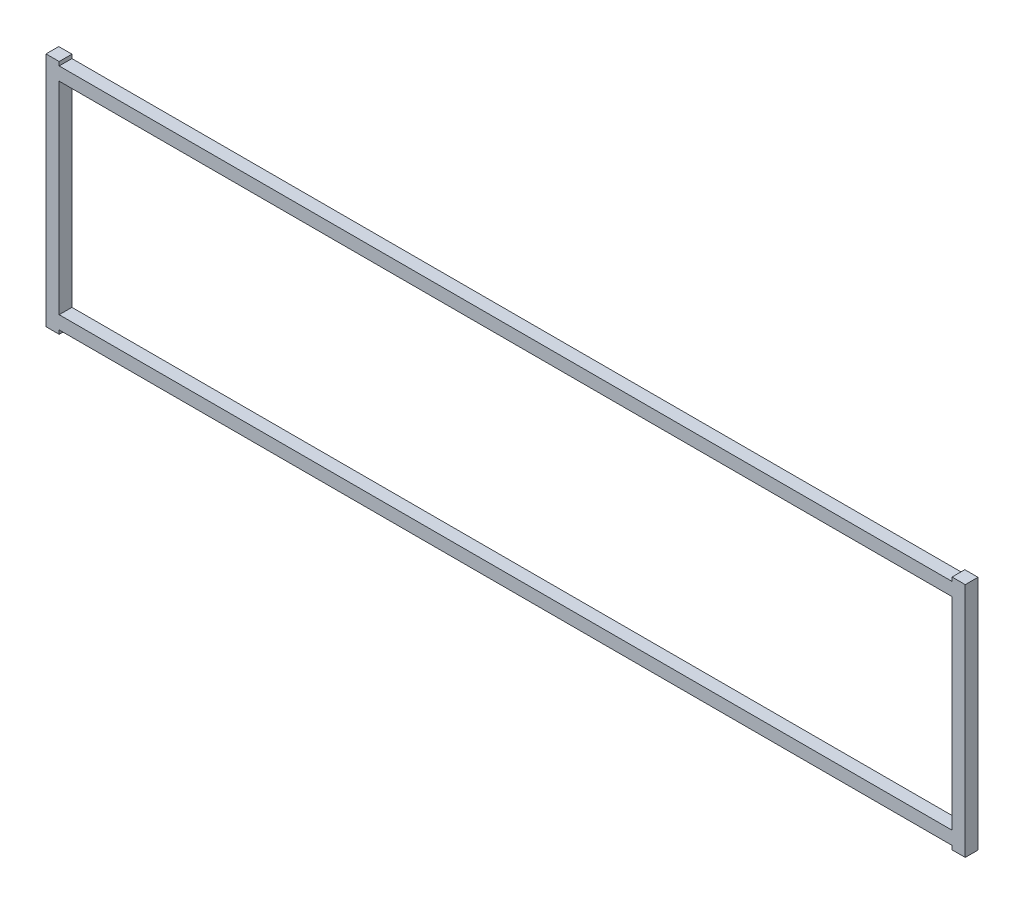
ISO-10303-21;
HEADER;
FILE_DESCRIPTION(('STEP AP214'),'2;1');
FILE_NAME('part.step','',(''),(''),'','','');
FILE_SCHEMA(('AUTOMOTIVE_DESIGN { 1 0 10303 214 1 1 1 1 }'));
ENDSEC;
DATA;
#1=APPLICATION_CONTEXT('core data for automotive mechanical design processes');
#2=APPLICATION_PROTOCOL_DEFINITION('international standard','automotive_design',2000,#1);
#3=PRODUCT_CONTEXT('',#1,'mechanical');
#4=PRODUCT('Part','Part','',(#3));
#5=PRODUCT_RELATED_PRODUCT_CATEGORY('part','',(#4));
#6=PRODUCT_DEFINITION_FORMATION('','',#4);
#7=PRODUCT_DEFINITION_CONTEXT('part definition',#1,'design');
#8=PRODUCT_DEFINITION('design','',#6,#7);
#9=PRODUCT_DEFINITION_SHAPE('','',#8);
#10=(LENGTH_UNIT() NAMED_UNIT(*) SI_UNIT(.MILLI.,.METRE.));
#11=(NAMED_UNIT(*) PLANE_ANGLE_UNIT() SI_UNIT($,.RADIAN.));
#12=(NAMED_UNIT(*) SI_UNIT($,.STERADIAN.) SOLID_ANGLE_UNIT());
#13=UNCERTAINTY_MEASURE_WITH_UNIT(LENGTH_MEASURE(1.E-05),#10,'distance_accuracy_value','');
#14=(GEOMETRIC_REPRESENTATION_CONTEXT(3) GLOBAL_UNCERTAINTY_ASSIGNED_CONTEXT((#13)) GLOBAL_UNIT_ASSIGNED_CONTEXT((#10,
#11,#12)) REPRESENTATION_CONTEXT('',''));
#15=CARTESIAN_POINT('',(0.,0.,0.));
#16=DIRECTION('',(0.,0.,1.));
#17=DIRECTION('',(1.,0.,0.));
#18=AXIS2_PLACEMENT_3D('',#15,#16,#17);
#19=CARTESIAN_POINT('',(0.,0.,6.35));
#20=DIRECTION('',(0.,0.,1.));
#21=DIRECTION('',(1.,0.,0.));
#22=AXIS2_PLACEMENT_3D('',#19,#20,#21);
#23=PLANE('',#22);
#24=DIRECTION('',(0.,-1.,0.));
#25=VECTOR('',#24,1.);
#26=CARTESIAN_POINT('',(222.1484,-56.87695,6.35));
#27=LINE('',#26,#25);
#28=CARTESIAN_POINT('',(222.1484,-56.87695,6.35));
#29=VERTEX_POINT('',#28);
#30=CARTESIAN_POINT('',(222.1484,-58.785125,6.35));
#31=VERTEX_POINT('',#30);
#32=EDGE_CURVE('E182',#29,#31,#27,.T.);
#33=ORIENTED_EDGE('',*,*,#32,.T.);
#34=DIRECTION('',(1.,0.,0.));
#35=VECTOR('',#34,1.);
#36=CARTESIAN_POINT('',(222.1484,-58.785125,6.35));
#37=LINE('',#36,#35);
#38=CARTESIAN_POINT('',(228.7016,-58.785125,6.35));
#39=VERTEX_POINT('',#38);
#40=EDGE_CURVE('E185',#31,#39,#37,.T.);
#41=ORIENTED_EDGE('',*,*,#40,.T.);
#42=DIRECTION('',(0.,1.,0.));
#43=VECTOR('',#42,1.);
#44=CARTESIAN_POINT('',(228.7016,-58.785125,6.35));
#45=LINE('',#44,#43);
#46=CARTESIAN_POINT('',(228.7016,58.785125,6.35));
#47=VERTEX_POINT('',#46);
#48=EDGE_CURVE('E188',#39,#47,#45,.T.);
#49=ORIENTED_EDGE('',*,*,#48,.T.);
#50=DIRECTION('',(-1.,0.,0.));
#51=VECTOR('',#50,1.);
#52=CARTESIAN_POINT('',(228.7016,58.785125,6.35));
#53=LINE('',#52,#51);
#54=CARTESIAN_POINT('',(222.1484,58.785125,6.35));
#55=VERTEX_POINT('',#54);
#56=EDGE_CURVE('E190',#47,#55,#53,.T.);
#57=ORIENTED_EDGE('',*,*,#56,.T.);
#58=DIRECTION('',(0.,-1.,0.));
#59=VECTOR('',#58,1.);
#60=CARTESIAN_POINT('',(222.1484,58.785125,6.35));
#61=LINE('',#60,#59);
#62=CARTESIAN_POINT('',(222.1484,56.87695,6.35));
#63=VERTEX_POINT('',#62);
#64=EDGE_CURVE('E192',#55,#63,#61,.T.);
#65=ORIENTED_EDGE('',*,*,#64,.T.);
#66=DIRECTION('',(-1.,0.,0.));
#67=VECTOR('',#66,1.);
#68=CARTESIAN_POINT('',(222.1484,56.87695,6.35));
#69=LINE('',#68,#67);
#70=CARTESIAN_POINT('',(-222.1484,56.87695,6.35));
#71=VERTEX_POINT('',#70);
#72=EDGE_CURVE('E194',#63,#71,#69,.T.);
#73=ORIENTED_EDGE('',*,*,#72,.T.);
#74=DIRECTION('',(0.,1.,0.));
#75=VECTOR('',#74,1.);
#76=CARTESIAN_POINT('',(-222.1484,56.87695,6.35));
#77=LINE('',#76,#75);
#78=CARTESIAN_POINT('',(-222.1484,58.785125,6.35));
#79=VERTEX_POINT('',#78);
#80=EDGE_CURVE('E196',#71,#79,#77,.T.);
#81=ORIENTED_EDGE('',*,*,#80,.T.);
#82=DIRECTION('',(-1.,0.,0.));
#83=VECTOR('',#82,1.);
#84=CARTESIAN_POINT('',(-222.1484,58.785125,6.35));
#85=LINE('',#84,#83);
#86=CARTESIAN_POINT('',(-228.7016,58.785125,6.35));
#87=VERTEX_POINT('',#86);
#88=EDGE_CURVE('E198',#79,#87,#85,.T.);
#89=ORIENTED_EDGE('',*,*,#88,.T.);
#90=DIRECTION('',(0.,-1.,0.));
#91=VECTOR('',#90,1.);
#92=CARTESIAN_POINT('',(-228.7016,58.785125,6.35));
#93=LINE('',#92,#91);
#94=CARTESIAN_POINT('',(-228.7016,-58.785125,6.35));
#95=VERTEX_POINT('',#94);
#96=EDGE_CURVE('E200',#87,#95,#93,.T.);
#97=ORIENTED_EDGE('',*,*,#96,.T.);
#98=DIRECTION('',(1.,0.,0.));
#99=VECTOR('',#98,1.);
#100=CARTESIAN_POINT('',(-228.7016,-58.785125,6.35));
#101=LINE('',#100,#99);
#102=CARTESIAN_POINT('',(-222.1484,-58.785125,6.35));
#103=VERTEX_POINT('',#102);
#104=EDGE_CURVE('E202',#95,#103,#101,.T.);
#105=ORIENTED_EDGE('',*,*,#104,.T.);
#106=DIRECTION('',(0.,1.,0.));
#107=VECTOR('',#106,1.);
#108=CARTESIAN_POINT('',(-222.1484,-58.785125,6.35));
#109=LINE('',#108,#107);
#110=CARTESIAN_POINT('',(-222.1484,-56.87695,6.35));
#111=VERTEX_POINT('',#110);
#112=EDGE_CURVE('E204',#103,#111,#109,.T.);
#113=ORIENTED_EDGE('',*,*,#112,.T.);
#114=DIRECTION('',(1.,0.,0.));
#115=VECTOR('',#114,1.);
#116=CARTESIAN_POINT('',(-222.1484,-56.87695,6.35));
#117=LINE('',#116,#115);
#118=EDGE_CURVE('E206',#111,#29,#117,.T.);
#119=ORIENTED_EDGE('',*,*,#118,.T.);
#120=EDGE_LOOP('',(#33,#41,#49,#57,#65,#73,#81,#89,#97,#105,#113,#119));
#121=FACE_BOUND('',#120,.T.);
#122=DIRECTION('',(0.,1.,0.));
#123=VECTOR('',#122,1.);
#124=CARTESIAN_POINT('',(222.1484,-50.32375,6.35));
#125=LINE('',#124,#123);
#126=CARTESIAN_POINT('',(222.1484,-50.32375,6.35));
#127=VERTEX_POINT('',#126);
#128=CARTESIAN_POINT('',(222.1484,50.32375,6.35));
#129=VERTEX_POINT('',#128);
#130=EDGE_CURVE('E154',#127,#129,#125,.T.);
#131=ORIENTED_EDGE('',*,*,#130,.F.);
#132=DIRECTION('',(1.,0.,0.));
#133=VECTOR('',#132,1.);
#134=CARTESIAN_POINT('',(-222.1484,-50.32375,6.35));
#135=LINE('',#134,#133);
#136=CARTESIAN_POINT('',(-222.1484,-50.32375,6.35));
#137=VERTEX_POINT('',#136);
#138=EDGE_CURVE('E146',#137,#127,#135,.T.);
#139=ORIENTED_EDGE('',*,*,#138,.F.);
#140=DIRECTION('',(0.,-1.,0.));
#141=VECTOR('',#140,1.);
#142=CARTESIAN_POINT('',(-222.1484,50.32375,6.35));
#143=LINE('',#142,#141);
#144=CARTESIAN_POINT('',(-222.1484,50.32375,6.35));
#145=VERTEX_POINT('',#144);
#146=EDGE_CURVE('E168',#145,#137,#143,.T.);
#147=ORIENTED_EDGE('',*,*,#146,.F.);
#148=DIRECTION('',(-1.,0.,0.));
#149=VECTOR('',#148,1.);
#150=CARTESIAN_POINT('',(222.1484,50.32375,6.35));
#151=LINE('',#150,#149);
#152=EDGE_CURVE('E166',#129,#145,#151,.T.);
#153=ORIENTED_EDGE('',*,*,#152,.F.);
#154=EDGE_LOOP('',(#131,#139,#147,#153));
#155=FACE_BOUND('',#154,.T.);
#156=ADVANCED_FACE('F33',(#121,#155),#23,.T.);
#157=CARTESIAN_POINT('',(0.,0.,0.));
#158=DIRECTION('',(0.,0.,1.));
#159=DIRECTION('',(1.,0.,0.));
#160=AXIS2_PLACEMENT_3D('',#157,#158,#159);
#161=PLANE('',#160);
#162=DIRECTION('',(0.,-1.,0.));
#163=VECTOR('',#162,1.);
#164=CARTESIAN_POINT('',(222.1484,-56.87695,0.));
#165=LINE('',#164,#163);
#166=CARTESIAN_POINT('',(222.1484,-56.87695,0.));
#167=VERTEX_POINT('',#166);
#168=CARTESIAN_POINT('',(222.1484,-58.785125,0.));
#169=VERTEX_POINT('',#168);
#170=EDGE_CURVE('E162',#167,#169,#165,.T.);
#171=ORIENTED_EDGE('',*,*,#170,.F.);
#172=DIRECTION('',(1.,0.,0.));
#173=VECTOR('',#172,1.);
#174=CARTESIAN_POINT('',(-222.1484,-56.87695,0.));
#175=LINE('',#174,#173);
#176=CARTESIAN_POINT('',(-222.1484,-56.87695,0.));
#177=VERTEX_POINT('',#176);
#178=EDGE_CURVE('E186',#177,#167,#175,.T.);
#179=ORIENTED_EDGE('',*,*,#178,.F.);
#180=DIRECTION('',(0.,1.,0.));
#181=VECTOR('',#180,1.);
#182=CARTESIAN_POINT('',(-222.1484,-58.785125,0.));
#183=LINE('',#182,#181);
#184=CARTESIAN_POINT('',(-222.1484,-58.785125,0.));
#185=VERTEX_POINT('',#184);
#186=EDGE_CURVE('E229',#185,#177,#183,.T.);
#187=ORIENTED_EDGE('',*,*,#186,.F.);
#188=DIRECTION('',(1.,0.,0.));
#189=VECTOR('',#188,1.);
#190=CARTESIAN_POINT('',(-228.7016,-58.785125,0.));
#191=LINE('',#190,#189);
#192=CARTESIAN_POINT('',(-228.7016,-58.785125,0.));
#193=VERTEX_POINT('',#192);
#194=EDGE_CURVE('E227',#193,#185,#191,.T.);
#195=ORIENTED_EDGE('',*,*,#194,.F.);
#196=DIRECTION('',(0.,-1.,0.));
#197=VECTOR('',#196,1.);
#198=CARTESIAN_POINT('',(-228.7016,58.785125,0.));
#199=LINE('',#198,#197);
#200=CARTESIAN_POINT('',(-228.7016,58.785125,0.));
#201=VERTEX_POINT('',#200);
#202=EDGE_CURVE('E225',#201,#193,#199,.T.);
#203=ORIENTED_EDGE('',*,*,#202,.F.);
#204=DIRECTION('',(-1.,0.,0.));
#205=VECTOR('',#204,1.);
#206=CARTESIAN_POINT('',(-222.1484,58.785125,0.));
#207=LINE('',#206,#205);
#208=CARTESIAN_POINT('',(-222.1484,58.785125,0.));
#209=VERTEX_POINT('',#208);
#210=EDGE_CURVE('E223',#209,#201,#207,.T.);
#211=ORIENTED_EDGE('',*,*,#210,.F.);
#212=DIRECTION('',(0.,1.,0.));
#213=VECTOR('',#212,1.);
#214=CARTESIAN_POINT('',(-222.1484,56.87695,0.));
#215=LINE('',#214,#213);
#216=CARTESIAN_POINT('',(-222.1484,56.87695,0.));
#217=VERTEX_POINT('',#216);
#218=EDGE_CURVE('E221',#217,#209,#215,.T.);
#219=ORIENTED_EDGE('',*,*,#218,.F.);
#220=DIRECTION('',(-1.,0.,0.));
#221=VECTOR('',#220,1.);
#222=CARTESIAN_POINT('',(222.1484,56.87695,0.));
#223=LINE('',#222,#221);
#224=CARTESIAN_POINT('',(222.1484,56.87695,0.));
#225=VERTEX_POINT('',#224);
#226=EDGE_CURVE('E219',#225,#217,#223,.T.);
#227=ORIENTED_EDGE('',*,*,#226,.F.);
#228=DIRECTION('',(0.,-1.,0.));
#229=VECTOR('',#228,1.);
#230=CARTESIAN_POINT('',(222.1484,58.785125,0.));
#231=LINE('',#230,#229);
#232=CARTESIAN_POINT('',(222.1484,58.785125,0.));
#233=VERTEX_POINT('',#232);
#234=EDGE_CURVE('E217',#233,#225,#231,.T.);
#235=ORIENTED_EDGE('',*,*,#234,.F.);
#236=DIRECTION('',(-1.,0.,0.));
#237=VECTOR('',#236,1.);
#238=CARTESIAN_POINT('',(228.7016,58.785125,0.));
#239=LINE('',#238,#237);
#240=CARTESIAN_POINT('',(228.7016,58.785125,0.));
#241=VERTEX_POINT('',#240);
#242=EDGE_CURVE('E215',#241,#233,#239,.T.);
#243=ORIENTED_EDGE('',*,*,#242,.F.);
#244=DIRECTION('',(0.,1.,0.));
#245=VECTOR('',#244,1.);
#246=CARTESIAN_POINT('',(228.7016,-58.785125,0.));
#247=LINE('',#246,#245);
#248=CARTESIAN_POINT('',(228.7016,-58.785125,0.));
#249=VERTEX_POINT('',#248);
#250=EDGE_CURVE('E213',#249,#241,#247,.T.);
#251=ORIENTED_EDGE('',*,*,#250,.F.);
#252=DIRECTION('',(1.,0.,0.));
#253=VECTOR('',#252,1.);
#254=CARTESIAN_POINT('',(222.1484,-58.785125,0.));
#255=LINE('',#254,#253);
#256=EDGE_CURVE('E211',#169,#249,#255,.T.);
#257=ORIENTED_EDGE('',*,*,#256,.F.);
#258=EDGE_LOOP('',(#171,#179,#187,#195,#203,#211,#219,#227,#235,#243,#251,#257));
#259=FACE_BOUND('',#258,.T.);
#260=DIRECTION('',(1.,0.,0.));
#261=VECTOR('',#260,1.);
#262=CARTESIAN_POINT('',(-222.1484,-50.32375,0.));
#263=LINE('',#262,#261);
#264=CARTESIAN_POINT('',(-222.1484,-50.32375,0.));
#265=VERTEX_POINT('',#264);
#266=CARTESIAN_POINT('',(222.1484,-50.32375,0.));
#267=VERTEX_POINT('',#266);
#268=EDGE_CURVE('E56',#265,#267,#263,.T.);
#269=ORIENTED_EDGE('',*,*,#268,.T.);
#270=DIRECTION('',(0.,1.,0.));
#271=VECTOR('',#270,1.);
#272=CARTESIAN_POINT('',(222.1484,-50.32375,0.));
#273=LINE('',#272,#271);
#274=CARTESIAN_POINT('',(222.1484,50.32375,0.));
#275=VERTEX_POINT('',#274);
#276=EDGE_CURVE('E161',#267,#275,#273,.T.);
#277=ORIENTED_EDGE('',*,*,#276,.T.);
#278=DIRECTION('',(-1.,0.,0.));
#279=VECTOR('',#278,1.);
#280=CARTESIAN_POINT('',(222.1484,50.32375,0.));
#281=LINE('',#280,#279);
#282=CARTESIAN_POINT('',(-222.1484,50.32375,0.));
#283=VERTEX_POINT('',#282);
#284=EDGE_CURVE('E174',#275,#283,#281,.T.);
#285=ORIENTED_EDGE('',*,*,#284,.T.);
#286=DIRECTION('',(0.,-1.,0.));
#287=VECTOR('',#286,1.);
#288=CARTESIAN_POINT('',(-222.1484,50.32375,0.));
#289=LINE('',#288,#287);
#290=EDGE_CURVE('E155',#283,#265,#289,.T.);
#291=ORIENTED_EDGE('',*,*,#290,.T.);
#292=EDGE_LOOP('',(#269,#277,#285,#291));
#293=FACE_BOUND('',#292,.T.);
#294=ADVANCED_FACE('F271',(#259,#293),#161,.F.);
#295=CARTESIAN_POINT('',(222.1484,-56.87695,6.35));
#296=DIRECTION('',(1.,0.,0.));
#297=DIRECTION('',(0.,0.,-1.));
#298=AXIS2_PLACEMENT_3D('',#295,#296,#297);
#299=PLANE('',#298);
#300=ORIENTED_EDGE('',*,*,#170,.T.);
#301=DIRECTION('',(0.,0.,-1.));
#302=VECTOR('',#301,1.);
#303=CARTESIAN_POINT('',(222.1484,-58.785125,6.35));
#304=LINE('',#303,#302);
#305=EDGE_CURVE('E11',#31,#169,#304,.T.);
#306=ORIENTED_EDGE('',*,*,#305,.F.);
#307=ORIENTED_EDGE('',*,*,#32,.F.);
#308=DIRECTION('',(0.,0.,-1.));
#309=VECTOR('',#308,1.);
#310=CARTESIAN_POINT('',(222.1484,-56.87695,6.35));
#311=LINE('',#310,#309);
#312=EDGE_CURVE('E208',#29,#167,#311,.T.);
#313=ORIENTED_EDGE('',*,*,#312,.T.);
#314=EDGE_LOOP('',(#300,#306,#307,#313));
#315=FACE_BOUND('',#314,.T.);
#316=ADVANCED_FACE('F35',(#315),#299,.F.);
#317=CARTESIAN_POINT('',(222.1484,-58.785125,6.35));
#318=DIRECTION('',(0.,1.,0.));
#319=DIRECTION('',(0.,0.,1.));
#320=AXIS2_PLACEMENT_3D('',#317,#318,#319);
#321=PLANE('',#320);
#322=ORIENTED_EDGE('',*,*,#256,.T.);
#323=DIRECTION('',(0.,0.,-1.));
#324=VECTOR('',#323,1.);
#325=CARTESIAN_POINT('',(228.7016,-58.785125,6.35));
#326=LINE('',#325,#324);
#327=EDGE_CURVE('E41',#39,#249,#326,.T.);
#328=ORIENTED_EDGE('',*,*,#327,.F.);
#329=ORIENTED_EDGE('',*,*,#40,.F.);
#330=ORIENTED_EDGE('',*,*,#305,.T.);
#331=EDGE_LOOP('',(#322,#328,#329,#330));
#332=FACE_BOUND('',#331,.T.);
#333=ADVANCED_FACE('F288',(#332),#321,.F.);
#334=CARTESIAN_POINT('',(228.7016,-58.785125,6.35));
#335=DIRECTION('',(-1.,0.,0.));
#336=DIRECTION('',(0.,0.,1.));
#337=AXIS2_PLACEMENT_3D('',#334,#335,#336);
#338=PLANE('',#337);
#339=ORIENTED_EDGE('',*,*,#250,.T.);
#340=DIRECTION('',(0.,0.,-1.));
#341=VECTOR('',#340,1.);
#342=CARTESIAN_POINT('',(228.7016,58.785125,6.35));
#343=LINE('',#342,#341);
#344=EDGE_CURVE('E258',#47,#241,#343,.T.);
#345=ORIENTED_EDGE('',*,*,#344,.F.);
#346=ORIENTED_EDGE('',*,*,#48,.F.);
#347=ORIENTED_EDGE('',*,*,#327,.T.);
#348=EDGE_LOOP('',(#339,#345,#346,#347));
#349=FACE_BOUND('',#348,.T.);
#350=ADVANCED_FACE('F265',(#349),#338,.F.);
#351=CARTESIAN_POINT('',(228.7016,58.785125,6.35));
#352=DIRECTION('',(0.,-1.,0.));
#353=DIRECTION('',(0.,0.,-1.));
#354=AXIS2_PLACEMENT_3D('',#351,#352,#353);
#355=PLANE('',#354);
#356=ORIENTED_EDGE('',*,*,#242,.T.);
#357=DIRECTION('',(0.,0.,-1.));
#358=VECTOR('',#357,1.);
#359=CARTESIAN_POINT('',(222.1484,58.785125,6.35));
#360=LINE('',#359,#358);
#361=EDGE_CURVE('E255',#55,#233,#360,.T.);
#362=ORIENTED_EDGE('',*,*,#361,.F.);
#363=ORIENTED_EDGE('',*,*,#56,.F.);
#364=ORIENTED_EDGE('',*,*,#344,.T.);
#365=EDGE_LOOP('',(#356,#362,#363,#364));
#366=FACE_BOUND('',#365,.T.);
#367=ADVANCED_FACE('F277',(#366),#355,.F.);
#368=CARTESIAN_POINT('',(222.1484,58.785125,6.35));
#369=DIRECTION('',(1.,0.,0.));
#370=DIRECTION('',(0.,1.,0.));
#371=AXIS2_PLACEMENT_3D('',#368,#369,#370);
#372=PLANE('',#371);
#373=ORIENTED_EDGE('',*,*,#234,.T.);
#374=DIRECTION('',(0.,0.,-1.));
#375=VECTOR('',#374,1.);
#376=CARTESIAN_POINT('',(222.1484,56.87695,6.35));
#377=LINE('',#376,#375);
#378=EDGE_CURVE('E252',#63,#225,#377,.T.);
#379=ORIENTED_EDGE('',*,*,#378,.F.);
#380=ORIENTED_EDGE('',*,*,#64,.F.);
#381=ORIENTED_EDGE('',*,*,#361,.T.);
#382=EDGE_LOOP('',(#373,#379,#380,#381));
#383=FACE_BOUND('',#382,.T.);
#384=ADVANCED_FACE('F281',(#383),#372,.F.);
#385=CARTESIAN_POINT('',(222.1484,56.87695,6.35));
#386=DIRECTION('',(0.,-1.,0.));
#387=DIRECTION('',(0.,0.,-1.));
#388=AXIS2_PLACEMENT_3D('',#385,#386,#387);
#389=PLANE('',#388);
#390=ORIENTED_EDGE('',*,*,#226,.T.);
#391=DIRECTION('',(0.,0.,-1.));
#392=VECTOR('',#391,1.);
#393=CARTESIAN_POINT('',(-222.1484,56.87695,6.35));
#394=LINE('',#393,#392);
#395=EDGE_CURVE('E249',#71,#217,#394,.T.);
#396=ORIENTED_EDGE('',*,*,#395,.F.);
#397=ORIENTED_EDGE('',*,*,#72,.F.);
#398=ORIENTED_EDGE('',*,*,#378,.T.);
#399=EDGE_LOOP('',(#390,#396,#397,#398));
#400=FACE_BOUND('',#399,.T.);
#401=ADVANCED_FACE('F321',(#400),#389,.F.);
#402=CARTESIAN_POINT('',(-222.1484,56.87695,6.35));
#403=DIRECTION('',(-1.,0.,0.));
#404=DIRECTION('',(0.,0.,1.));
#405=AXIS2_PLACEMENT_3D('',#402,#403,#404);
#406=PLANE('',#405);
#407=ORIENTED_EDGE('',*,*,#218,.T.);
#408=DIRECTION('',(0.,0.,-1.));
#409=VECTOR('',#408,1.);
#410=CARTESIAN_POINT('',(-222.1484,58.785125,6.35));
#411=LINE('',#410,#409);
#412=EDGE_CURVE('E246',#79,#209,#411,.T.);
#413=ORIENTED_EDGE('',*,*,#412,.F.);
#414=ORIENTED_EDGE('',*,*,#80,.F.);
#415=ORIENTED_EDGE('',*,*,#395,.T.);
#416=EDGE_LOOP('',(#407,#413,#414,#415));
#417=FACE_BOUND('',#416,.T.);
#418=ADVANCED_FACE('F319',(#417),#406,.F.);
#419=CARTESIAN_POINT('',(-222.1484,58.785125,6.35));
#420=DIRECTION('',(0.,-1.,0.));
#421=DIRECTION('',(0.,0.,-1.));
#422=AXIS2_PLACEMENT_3D('',#419,#420,#421);
#423=PLANE('',#422);
#424=ORIENTED_EDGE('',*,*,#210,.T.);
#425=DIRECTION('',(0.,0.,-1.));
#426=VECTOR('',#425,1.);
#427=CARTESIAN_POINT('',(-228.7016,58.785125,6.35));
#428=LINE('',#427,#426);
#429=EDGE_CURVE('E243',#87,#201,#428,.T.);
#430=ORIENTED_EDGE('',*,*,#429,.F.);
#431=ORIENTED_EDGE('',*,*,#88,.F.);
#432=ORIENTED_EDGE('',*,*,#412,.T.);
#433=EDGE_LOOP('',(#424,#430,#431,#432));
#434=FACE_BOUND('',#433,.T.);
#435=ADVANCED_FACE('F315',(#434),#423,.F.);
#436=CARTESIAN_POINT('',(-228.7016,58.785125,6.35));
#437=DIRECTION('',(1.,0.,0.));
#438=DIRECTION('',(0.,0.,-1.));
#439=AXIS2_PLACEMENT_3D('',#436,#437,#438);
#440=PLANE('',#439);
#441=ORIENTED_EDGE('',*,*,#202,.T.);
#442=DIRECTION('',(0.,0.,-1.));
#443=VECTOR('',#442,1.);
#444=CARTESIAN_POINT('',(-228.7016,-58.785125,6.35));
#445=LINE('',#444,#443);
#446=EDGE_CURVE('E240',#95,#193,#445,.T.);
#447=ORIENTED_EDGE('',*,*,#446,.F.);
#448=ORIENTED_EDGE('',*,*,#96,.F.);
#449=ORIENTED_EDGE('',*,*,#429,.T.);
#450=EDGE_LOOP('',(#441,#447,#448,#449));
#451=FACE_BOUND('',#450,.T.);
#452=ADVANCED_FACE('F310',(#451),#440,.F.);
#453=CARTESIAN_POINT('',(-228.7016,-58.785125,6.35));
#454=DIRECTION('',(0.,1.,0.));
#455=DIRECTION('',(0.,0.,1.));
#456=AXIS2_PLACEMENT_3D('',#453,#454,#455);
#457=PLANE('',#456);
#458=ORIENTED_EDGE('',*,*,#194,.T.);
#459=DIRECTION('',(0.,0.,-1.));
#460=VECTOR('',#459,1.);
#461=CARTESIAN_POINT('',(-222.1484,-58.785125,6.35));
#462=LINE('',#461,#460);
#463=EDGE_CURVE('E237',#103,#185,#462,.T.);
#464=ORIENTED_EDGE('',*,*,#463,.F.);
#465=ORIENTED_EDGE('',*,*,#104,.F.);
#466=ORIENTED_EDGE('',*,*,#446,.T.);
#467=EDGE_LOOP('',(#458,#464,#465,#466));
#468=FACE_BOUND('',#467,.T.);
#469=ADVANCED_FACE('F304',(#468),#457,.F.);
#470=CARTESIAN_POINT('',(-222.1484,-58.785125,6.35));
#471=DIRECTION('',(-1.,0.,0.));
#472=DIRECTION('',(0.,-1.,0.));
#473=AXIS2_PLACEMENT_3D('',#470,#471,#472);
#474=PLANE('',#473);
#475=ORIENTED_EDGE('',*,*,#186,.T.);
#476=DIRECTION('',(0.,0.,-1.));
#477=VECTOR('',#476,1.);
#478=CARTESIAN_POINT('',(-222.1484,-56.87695,6.35));
#479=LINE('',#478,#477);
#480=EDGE_CURVE('E234',#111,#177,#479,.T.);
#481=ORIENTED_EDGE('',*,*,#480,.F.);
#482=ORIENTED_EDGE('',*,*,#112,.F.);
#483=ORIENTED_EDGE('',*,*,#463,.T.);
#484=EDGE_LOOP('',(#475,#481,#482,#483));
#485=FACE_BOUND('',#484,.T.);
#486=ADVANCED_FACE('F300',(#485),#474,.F.);
#487=CARTESIAN_POINT('',(-222.1484,-56.87695,6.35));
#488=DIRECTION('',(0.,1.,0.));
#489=DIRECTION('',(0.,0.,1.));
#490=AXIS2_PLACEMENT_3D('',#487,#488,#489);
#491=PLANE('',#490);
#492=ORIENTED_EDGE('',*,*,#178,.T.);
#493=ORIENTED_EDGE('',*,*,#312,.F.);
#494=ORIENTED_EDGE('',*,*,#118,.F.);
#495=ORIENTED_EDGE('',*,*,#480,.T.);
#496=EDGE_LOOP('',(#492,#493,#494,#495));
#497=FACE_BOUND('',#496,.T.);
#498=ADVANCED_FACE('F295',(#497),#491,.F.);
#499=CARTESIAN_POINT('',(-222.1484,-50.32375,6.35));
#500=DIRECTION('',(0.,1.,0.));
#501=DIRECTION('',(0.,0.,1.));
#502=AXIS2_PLACEMENT_3D('',#499,#500,#501);
#503=PLANE('',#502);
#504=ORIENTED_EDGE('',*,*,#268,.F.);
#505=DIRECTION('',(0.,0.,-1.));
#506=VECTOR('',#505,1.);
#507=CARTESIAN_POINT('',(-222.1484,-50.32375,6.35));
#508=LINE('',#507,#506);
#509=EDGE_CURVE('E150',#137,#265,#508,.T.);
#510=ORIENTED_EDGE('',*,*,#509,.F.);
#511=ORIENTED_EDGE('',*,*,#138,.T.);
#512=DIRECTION('',(0.,0.,-1.));
#513=VECTOR('',#512,1.);
#514=CARTESIAN_POINT('',(222.1484,-50.32375,6.35));
#515=LINE('',#514,#513);
#516=EDGE_CURVE('E149',#127,#267,#515,.T.);
#517=ORIENTED_EDGE('',*,*,#516,.T.);
#518=EDGE_LOOP('',(#504,#510,#511,#517));
#519=FACE_BOUND('',#518,.T.);
#520=ADVANCED_FACE('F148',(#519),#503,.T.);
#521=CARTESIAN_POINT('',(222.1484,-50.32375,6.35));
#522=DIRECTION('',(-1.,0.,0.));
#523=DIRECTION('',(0.,0.,1.));
#524=AXIS2_PLACEMENT_3D('',#521,#522,#523);
#525=PLANE('',#524);
#526=ORIENTED_EDGE('',*,*,#276,.F.);
#527=ORIENTED_EDGE('',*,*,#516,.F.);
#528=ORIENTED_EDGE('',*,*,#130,.T.);
#529=DIRECTION('',(0.,0.,-1.));
#530=VECTOR('',#529,1.);
#531=CARTESIAN_POINT('',(222.1484,50.32375,6.35));
#532=LINE('',#531,#530);
#533=EDGE_CURVE('E163',#129,#275,#532,.T.);
#534=ORIENTED_EDGE('',*,*,#533,.T.);
#535=EDGE_LOOP('',(#526,#527,#528,#534));
#536=FACE_BOUND('',#535,.T.);
#537=ADVANCED_FACE('F158',(#536),#525,.T.);
#538=CARTESIAN_POINT('',(222.1484,50.32375,6.35));
#539=DIRECTION('',(0.,-1.,0.));
#540=DIRECTION('',(0.,0.,-1.));
#541=AXIS2_PLACEMENT_3D('',#538,#539,#540);
#542=PLANE('',#541);
#543=ORIENTED_EDGE('',*,*,#284,.F.);
#544=ORIENTED_EDGE('',*,*,#533,.F.);
#545=ORIENTED_EDGE('',*,*,#152,.T.);
#546=DIRECTION('',(0.,0.,-1.));
#547=VECTOR('',#546,1.);
#548=CARTESIAN_POINT('',(-222.1484,50.32375,6.35));
#549=LINE('',#548,#547);
#550=EDGE_CURVE('E48',#145,#283,#549,.T.);
#551=ORIENTED_EDGE('',*,*,#550,.T.);
#552=EDGE_LOOP('',(#543,#544,#545,#551));
#553=FACE_BOUND('',#552,.T.);
#554=ADVANCED_FACE('F379',(#553),#542,.T.);
#555=CARTESIAN_POINT('',(-222.1484,50.32375,6.35));
#556=DIRECTION('',(1.,0.,0.));
#557=DIRECTION('',(0.,0.,-1.));
#558=AXIS2_PLACEMENT_3D('',#555,#556,#557);
#559=PLANE('',#558);
#560=ORIENTED_EDGE('',*,*,#290,.F.);
#561=ORIENTED_EDGE('',*,*,#550,.F.);
#562=ORIENTED_EDGE('',*,*,#146,.T.);
#563=ORIENTED_EDGE('',*,*,#509,.T.);
#564=EDGE_LOOP('',(#560,#561,#562,#563));
#565=FACE_BOUND('',#564,.T.);
#566=ADVANCED_FACE('F385',(#565),#559,.T.);
#567=CLOSED_SHELL('',(#156,#294,#316,#333,#350,#367,#384,#401,#418,#435,#452,#469,#486,#498,
#520,#537,#554,#566));
#568=MANIFOLD_SOLID_BREP('B2',#567);
#569=ADVANCED_BREP_SHAPE_REPRESENTATION('',(#18,#568),#14);
#570=SHAPE_DEFINITION_REPRESENTATION(#9,#569);
ENDSEC;
END-ISO-10303-21;
